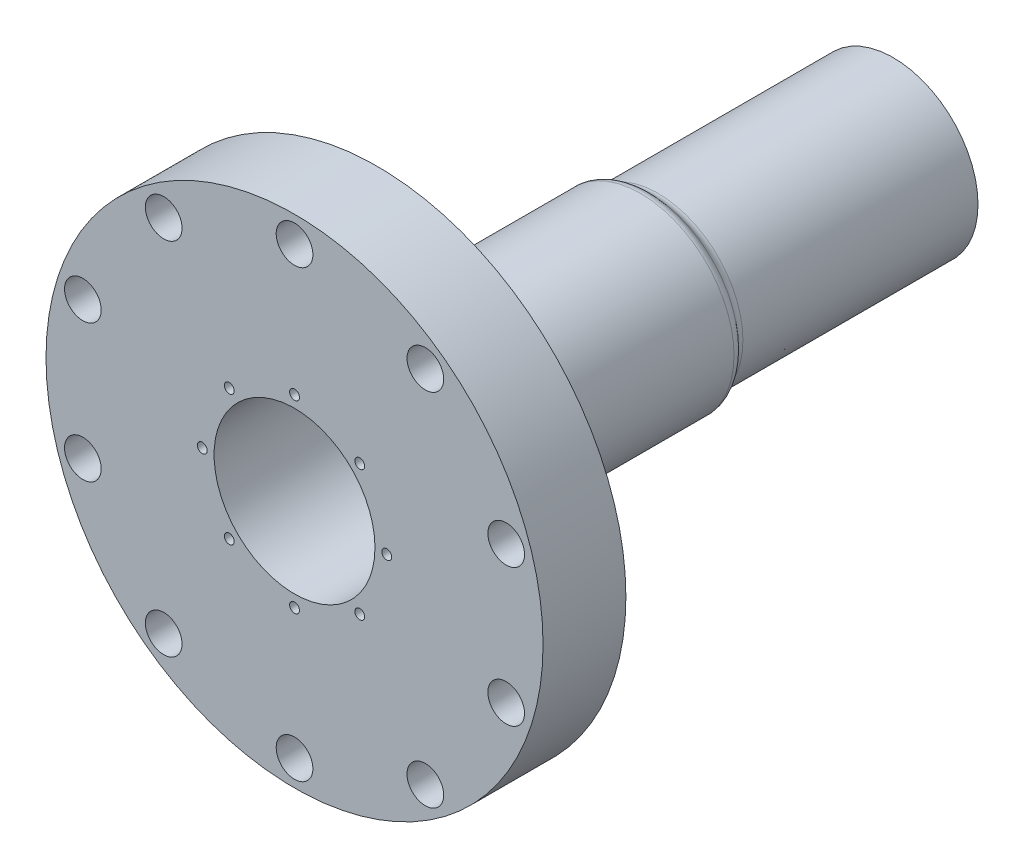
ISO-10303-21;
HEADER;
FILE_DESCRIPTION(('STEP AP214'),'2;1');
FILE_NAME('part.step','',(''),(''),'','','');
FILE_SCHEMA(('AUTOMOTIVE_DESIGN { 1 0 10303 214 1 1 1 1 }'));
ENDSEC;
DATA;
#1=APPLICATION_CONTEXT('core data for automotive mechanical design processes');
#2=APPLICATION_PROTOCOL_DEFINITION('international standard','automotive_design',2000,#1);
#3=PRODUCT_CONTEXT('',#1,'mechanical');
#4=PRODUCT('Part','Part','',(#3));
#5=PRODUCT_RELATED_PRODUCT_CATEGORY('part','',(#4));
#6=PRODUCT_DEFINITION_FORMATION('','',#4);
#7=PRODUCT_DEFINITION_CONTEXT('part definition',#1,'design');
#8=PRODUCT_DEFINITION('design','',#6,#7);
#9=PRODUCT_DEFINITION_SHAPE('','',#8);
#10=(LENGTH_UNIT() NAMED_UNIT(*) SI_UNIT(.MILLI.,.METRE.));
#11=(NAMED_UNIT(*) PLANE_ANGLE_UNIT() SI_UNIT($,.RADIAN.));
#12=(NAMED_UNIT(*) SI_UNIT($,.STERADIAN.) SOLID_ANGLE_UNIT());
#13=UNCERTAINTY_MEASURE_WITH_UNIT(LENGTH_MEASURE(1.E-05),#10,'distance_accuracy_value','');
#14=(GEOMETRIC_REPRESENTATION_CONTEXT(3) GLOBAL_UNCERTAINTY_ASSIGNED_CONTEXT((#13)) GLOBAL_UNIT_ASSIGNED_CONTEXT((#10,
#11,#12)) REPRESENTATION_CONTEXT('',''));
#15=CARTESIAN_POINT('',(0.,0.,0.));
#16=DIRECTION('',(0.,0.,1.));
#17=DIRECTION('',(1.,0.,0.));
#18=AXIS2_PLACEMENT_3D('',#15,#16,#17);
#19=CARTESIAN_POINT('',(0.,0.,-19.05));
#20=DIRECTION('',(0.,0.,1.));
#21=DIRECTION('',(1.,0.,0.));
#22=AXIS2_PLACEMENT_3D('',#19,#20,#21);
#23=PLANE('',#22);
#24=CARTESIAN_POINT('',(0.,0.,-19.05));
#25=DIRECTION('',(0.,0.,1.));
#26=DIRECTION('',(1.,0.,0.));
#27=AXIS2_PLACEMENT_3D('',#24,#25,#26);
#28=CIRCLE('',#27,57.15);
#29=CARTESIAN_POINT('',(57.15,0.,-19.05));
#30=VERTEX_POINT('',#29);
#31=EDGE_CURVE('E189',#30,#30,#28,.T.);
#32=ORIENTED_EDGE('',*,*,#31,.F.);
#33=EDGE_LOOP('',(#32));
#34=FACE_BOUND('',#33,.T.);
#35=CARTESIAN_POINT('',(0.,51.181,-19.05));
#36=DIRECTION('',(0.,0.,1.));
#37=DIRECTION('',(1.,0.,0.));
#38=AXIS2_PLACEMENT_3D('',#35,#36,#37);
#39=CIRCLE('',#38,4.2164);
#40=CARTESIAN_POINT('',(4.2164,51.181,-19.05));
#41=VERTEX_POINT('',#40);
#42=EDGE_CURVE('E185',#41,#41,#39,.F.);
#43=ORIENTED_EDGE('',*,*,#42,.F.);
#44=EDGE_LOOP('',(#43));
#45=FACE_BOUND('',#44,.T.);
#46=CARTESIAN_POINT('',(-30.0834369975811,41.4062987891042,-19.05));
#47=DIRECTION('',(0.,0.,1.));
#48=DIRECTION('',(1.,0.,0.));
#49=AXIS2_PLACEMENT_3D('',#46,#47,#48);
#50=CIRCLE('',#49,4.2164);
#51=CARTESIAN_POINT('',(-25.8670369975811,41.4062987891042,-19.05));
#52=VERTEX_POINT('',#51);
#53=EDGE_CURVE('E179',#52,#52,#50,.F.);
#54=ORIENTED_EDGE('',*,*,#53,.F.);
#55=EDGE_LOOP('',(#54));
#56=FACE_BOUND('',#55,.T.);
#57=CARTESIAN_POINT('',(-48.6760235605023,15.8157987891041,-19.05));
#58=DIRECTION('',(0.,0.,1.));
#59=DIRECTION('',(1.,0.,0.));
#60=AXIS2_PLACEMENT_3D('',#57,#58,#59);
#61=CIRCLE('',#60,4.2164);
#62=CARTESIAN_POINT('',(-44.4596235605023,15.8157987891041,-19.05));
#63=VERTEX_POINT('',#62);
#64=EDGE_CURVE('E173',#63,#63,#61,.F.);
#65=ORIENTED_EDGE('',*,*,#64,.F.);
#66=EDGE_LOOP('',(#65));
#67=FACE_BOUND('',#66,.T.);
#68=CARTESIAN_POINT('',(-48.6760235605022,-15.8157987891044,-19.05));
#69=DIRECTION('',(0.,0.,1.));
#70=DIRECTION('',(1.,0.,0.));
#71=AXIS2_PLACEMENT_3D('',#68,#69,#70);
#72=CIRCLE('',#71,4.2164);
#73=CARTESIAN_POINT('',(-44.4596235605022,-15.8157987891044,-19.05));
#74=VERTEX_POINT('',#73);
#75=EDGE_CURVE('E167',#74,#74,#72,.F.);
#76=ORIENTED_EDGE('',*,*,#75,.F.);
#77=EDGE_LOOP('',(#76));
#78=FACE_BOUND('',#77,.T.);
#79=CARTESIAN_POINT('',(-30.0834369975808,-41.4062987891044,-19.05));
#80=DIRECTION('',(0.,0.,1.));
#81=DIRECTION('',(1.,0.,0.));
#82=AXIS2_PLACEMENT_3D('',#79,#80,#81);
#83=CIRCLE('',#82,4.2164);
#84=CARTESIAN_POINT('',(-25.8670369975808,-41.4062987891044,-19.05));
#85=VERTEX_POINT('',#84);
#86=EDGE_CURVE('E161',#85,#85,#83,.F.);
#87=ORIENTED_EDGE('',*,*,#86,.F.);
#88=EDGE_LOOP('',(#87));
#89=FACE_BOUND('',#88,.T.);
#90=CARTESIAN_POINT('',(3.57395219809879E-13,-51.181,-19.05));
#91=DIRECTION('',(0.,0.,1.));
#92=DIRECTION('',(1.,0.,0.));
#93=AXIS2_PLACEMENT_3D('',#90,#91,#92);
#94=CIRCLE('',#93,4.2164);
#95=CARTESIAN_POINT('',(4.21640000000036,-51.181,-19.05));
#96=VERTEX_POINT('',#95);
#97=EDGE_CURVE('E155',#96,#96,#94,.F.);
#98=ORIENTED_EDGE('',*,*,#97,.F.);
#99=EDGE_LOOP('',(#98));
#100=FACE_BOUND('',#99,.T.);
#101=CARTESIAN_POINT('',(30.0834369975814,-41.4062987891039,-19.05));
#102=DIRECTION('',(0.,0.,1.));
#103=DIRECTION('',(1.,0.,0.));
#104=AXIS2_PLACEMENT_3D('',#101,#102,#103);
#105=CIRCLE('',#104,4.2164);
#106=CARTESIAN_POINT('',(34.2998369975814,-41.4062987891039,-19.05));
#107=VERTEX_POINT('',#106);
#108=EDGE_CURVE('E149',#107,#107,#105,.F.);
#109=ORIENTED_EDGE('',*,*,#108,.F.);
#110=EDGE_LOOP('',(#109));
#111=FACE_BOUND('',#110,.T.);
#112=CARTESIAN_POINT('',(48.6760235605024,-15.8157987891037,-19.05));
#113=DIRECTION('',(0.,0.,1.));
#114=DIRECTION('',(1.,0.,0.));
#115=AXIS2_PLACEMENT_3D('',#112,#113,#114);
#116=CIRCLE('',#115,4.2164);
#117=CARTESIAN_POINT('',(52.8924235605024,-15.8157987891037,-19.05));
#118=VERTEX_POINT('',#117);
#119=EDGE_CURVE('E143',#118,#118,#116,.F.);
#120=ORIENTED_EDGE('',*,*,#119,.F.);
#121=EDGE_LOOP('',(#120));
#122=FACE_BOUND('',#121,.T.);
#123=CARTESIAN_POINT('',(48.6760235605021,15.8157987891047,-19.05));
#124=DIRECTION('',(0.,0.,1.));
#125=DIRECTION('',(1.,0.,0.));
#126=AXIS2_PLACEMENT_3D('',#123,#124,#125);
#127=CIRCLE('',#126,4.2164);
#128=CARTESIAN_POINT('',(52.8924235605021,15.8157987891047,-19.05));
#129=VERTEX_POINT('',#128);
#130=EDGE_CURVE('E137',#129,#129,#127,.F.);
#131=ORIENTED_EDGE('',*,*,#130,.F.);
#132=EDGE_LOOP('',(#131));
#133=FACE_BOUND('',#132,.T.);
#134=CARTESIAN_POINT('',(30.0834369975805,41.4062987891046,-19.05));
#135=DIRECTION('',(0.,0.,1.));
#136=DIRECTION('',(1.,0.,0.));
#137=AXIS2_PLACEMENT_3D('',#134,#135,#136);
#138=CIRCLE('',#137,4.2164);
#139=CARTESIAN_POINT('',(34.2998369975805,41.4062987891046,-19.05));
#140=VERTEX_POINT('',#139);
#141=EDGE_CURVE('E131',#140,#140,#138,.F.);
#142=ORIENTED_EDGE('',*,*,#141,.F.);
#143=EDGE_LOOP('',(#142));
#144=FACE_BOUND('',#143,.T.);
#145=CARTESIAN_POINT('',(0.,0.,-19.05));
#146=DIRECTION('',(0.,0.,1.));
#147=DIRECTION('',(1.,0.,0.));
#148=AXIS2_PLACEMENT_3D('',#145,#146,#147);
#149=CIRCLE('',#148,21.5);
#150=CARTESIAN_POINT('',(21.5,0.,-19.05));
#151=VERTEX_POINT('',#150);
#152=EDGE_CURVE('E200',#151,#151,#149,.F.);
#153=ORIENTED_EDGE('',*,*,#152,.F.);
#154=EDGE_LOOP('',(#153));
#155=FACE_BOUND('',#154,.T.);
#156=ADVANCED_FACE('F36',(#34,#45,#56,#67,#78,#89,#100,#111,#122,#133,#144,#155),#23,.F.);
#157=CARTESIAN_POINT('',(0.,0.,-137.668));
#158=DIRECTION('',(0.,0.,1.));
#159=DIRECTION('',(1.,0.,0.));
#160=AXIS2_PLACEMENT_3D('',#157,#158,#159);
#161=CYLINDRICAL_SURFACE('',#160,18.5);
#162=CARTESIAN_POINT('',(0.,0.,0.));
#163=DIRECTION('',(0.,0.,1.));
#164=DIRECTION('',(1.,0.,0.));
#165=AXIS2_PLACEMENT_3D('',#162,#163,#164);
#166=CIRCLE('',#165,18.5);
#167=CARTESIAN_POINT('',(18.5,0.,0.));
#168=VERTEX_POINT('',#167);
#169=EDGE_CURVE('E192',#168,#168,#166,.T.);
#170=ORIENTED_EDGE('',*,*,#169,.T.);
#171=EDGE_LOOP('',(#170));
#172=FACE_BOUND('',#171,.T.);
#173=CARTESIAN_POINT('',(0.,0.,-112.268));
#174=DIRECTION('',(0.,0.,-1.));
#175=DIRECTION('',(-1.,0.,0.));
#176=AXIS2_PLACEMENT_3D('',#173,#174,#175);
#177=CIRCLE('',#176,18.5);
#178=CARTESIAN_POINT('',(-18.5,0.,-112.268));
#179=VERTEX_POINT('',#178);
#180=EDGE_CURVE('E86',#179,#179,#177,.F.);
#181=ORIENTED_EDGE('',*,*,#180,.F.);
#182=EDGE_LOOP('',(#181));
#183=FACE_BOUND('',#182,.T.);
#184=ADVANCED_FACE('F222',(#172,#183),#161,.F.);
#185=CARTESIAN_POINT('',(0.,0.,-137.668));
#186=DIRECTION('',(0.,0.,1.));
#187=DIRECTION('',(1.,0.,0.));
#188=AXIS2_PLACEMENT_3D('',#185,#186,#187);
#189=CYLINDRICAL_SURFACE('',#188,19.5);
#190=CARTESIAN_POINT('',(0.,0.,-83.6078672461467));
#191=DIRECTION('',(0.,0.,1.));
#192=DIRECTION('',(1.,0.,0.));
#193=AXIS2_PLACEMENT_3D('',#190,#191,#192);
#194=CIRCLE('',#193,19.5);
#195=CARTESIAN_POINT('',(19.5,0.,-83.6078672461467));
#196=VERTEX_POINT('',#195);
#197=EDGE_CURVE('E11',#196,#196,#194,.F.);
#198=ORIENTED_EDGE('',*,*,#197,.T.);
#199=EDGE_LOOP('',(#198));
#200=FACE_BOUND('',#199,.T.);
#201=CARTESIAN_POINT('',(0.,0.,-137.668));
#202=DIRECTION('',(0.,0.,1.));
#203=DIRECTION('',(1.,0.,0.));
#204=AXIS2_PLACEMENT_3D('',#201,#202,#203);
#205=CIRCLE('',#204,19.5);
#206=CARTESIAN_POINT('',(19.5,0.,-137.668));
#207=VERTEX_POINT('',#206);
#208=EDGE_CURVE('E197',#207,#207,#205,.T.);
#209=ORIENTED_EDGE('',*,*,#208,.T.);
#210=EDGE_LOOP('',(#209));
#211=FACE_BOUND('',#210,.T.);
#212=ADVANCED_FACE('F228',(#200,#211),#189,.T.);
#213=CARTESIAN_POINT('',(0.,0.,-137.668));
#214=DIRECTION('',(0.,0.,1.));
#215=DIRECTION('',(1.,0.,0.));
#216=AXIS2_PLACEMENT_3D('',#213,#214,#215);
#217=PLANE('',#216);
#218=CARTESIAN_POINT('',(0.,0.,-137.668));
#219=DIRECTION('',(0.,0.,-1.));
#220=DIRECTION('',(-1.,0.,0.));
#221=AXIS2_PLACEMENT_3D('',#218,#219,#220);
#222=CIRCLE('',#221,19.);
#223=CARTESIAN_POINT('',(-19.,0.,-137.668));
#224=VERTEX_POINT('',#223);
#225=EDGE_CURVE('E619',#224,#224,#222,.T.);
#226=ORIENTED_EDGE('',*,*,#225,.F.);
#227=EDGE_LOOP('',(#226));
#228=FACE_BOUND('',#227,.T.);
#229=ORIENTED_EDGE('',*,*,#208,.F.);
#230=EDGE_LOOP('',(#229));
#231=FACE_BOUND('',#230,.T.);
#232=ADVANCED_FACE('F242',(#228,#231),#217,.F.);
#233=CARTESIAN_POINT('',(0.,0.,0.));
#234=DIRECTION('',(0.,0.,1.));
#235=DIRECTION('',(1.,0.,0.));
#236=AXIS2_PLACEMENT_3D('',#233,#234,#235);
#237=PLANE('',#236);
#238=CARTESIAN_POINT('',(15.,-15.,0.));
#239=DIRECTION('',(0.,0.,1.));
#240=DIRECTION('',(1.,0.,0.));
#241=AXIS2_PLACEMENT_3D('',#238,#239,#240);
#242=CIRCLE('',#241,1.13029999999999);
#243=CARTESIAN_POINT('',(16.1303,-15.,0.));
#244=VERTEX_POINT('',#243);
#245=EDGE_CURVE('E80',#244,#244,#242,.T.);
#246=ORIENTED_EDGE('',*,*,#245,.F.);
#247=EDGE_LOOP('',(#246));
#248=FACE_BOUND('',#247,.T.);
#249=CARTESIAN_POINT('',(-15.,-15.,0.));
#250=DIRECTION('',(0.,0.,1.));
#251=DIRECTION('',(1.,0.,0.));
#252=AXIS2_PLACEMENT_3D('',#249,#250,#251);
#253=CIRCLE('',#252,1.13029999999999);
#254=CARTESIAN_POINT('',(-13.8697,-15.,0.));
#255=VERTEX_POINT('',#254);
#256=EDGE_CURVE('E79',#255,#255,#253,.T.);
#257=ORIENTED_EDGE('',*,*,#256,.F.);
#258=EDGE_LOOP('',(#257));
#259=FACE_BOUND('',#258,.T.);
#260=CARTESIAN_POINT('',(-15.,15.,0.));
#261=DIRECTION('',(0.,0.,1.));
#262=DIRECTION('',(1.,0.,0.));
#263=AXIS2_PLACEMENT_3D('',#260,#261,#262);
#264=CIRCLE('',#263,1.13029999999999);
#265=CARTESIAN_POINT('',(-13.8697,15.,0.));
#266=VERTEX_POINT('',#265);
#267=EDGE_CURVE('E92',#266,#266,#264,.T.);
#268=ORIENTED_EDGE('',*,*,#267,.F.);
#269=EDGE_LOOP('',(#268));
#270=FACE_BOUND('',#269,.T.);
#271=CARTESIAN_POINT('',(15.,15.,0.));
#272=DIRECTION('',(0.,0.,1.));
#273=DIRECTION('',(1.,0.,0.));
#274=AXIS2_PLACEMENT_3D('',#271,#272,#273);
#275=CIRCLE('',#274,1.13029999999999);
#276=CARTESIAN_POINT('',(16.1303,15.,0.));
#277=VERTEX_POINT('',#276);
#278=EDGE_CURVE('E98',#277,#277,#275,.T.);
#279=ORIENTED_EDGE('',*,*,#278,.F.);
#280=EDGE_LOOP('',(#279));
#281=FACE_BOUND('',#280,.T.);
#282=CARTESIAN_POINT('',(0.,21.2132034355964,0.));
#283=DIRECTION('',(0.,0.,1.));
#284=DIRECTION('',(1.,0.,0.));
#285=AXIS2_PLACEMENT_3D('',#282,#283,#284);
#286=CIRCLE('',#285,1.13029999999999);
#287=CARTESIAN_POINT('',(1.13030000000002,21.2132034355964,0.));
#288=VERTEX_POINT('',#287);
#289=EDGE_CURVE('E104',#288,#288,#286,.T.);
#290=ORIENTED_EDGE('',*,*,#289,.F.);
#291=EDGE_LOOP('',(#290));
#292=FACE_BOUND('',#291,.T.);
#293=CARTESIAN_POINT('',(-21.2132034355965,0.,0.));
#294=DIRECTION('',(0.,0.,1.));
#295=DIRECTION('',(1.,0.,0.));
#296=AXIS2_PLACEMENT_3D('',#293,#294,#295);
#297=CIRCLE('',#296,1.13029999999999);
#298=CARTESIAN_POINT('',(-20.0829034355965,0.,0.));
#299=VERTEX_POINT('',#298);
#300=EDGE_CURVE('E110',#299,#299,#297,.T.);
#301=ORIENTED_EDGE('',*,*,#300,.F.);
#302=EDGE_LOOP('',(#301));
#303=FACE_BOUND('',#302,.T.);
#304=CARTESIAN_POINT('',(21.2132034355965,0.,0.));
#305=DIRECTION('',(0.,0.,1.));
#306=DIRECTION('',(1.,0.,0.));
#307=AXIS2_PLACEMENT_3D('',#304,#305,#306);
#308=CIRCLE('',#307,1.13029999999999);
#309=CARTESIAN_POINT('',(22.3435034355964,0.,0.));
#310=VERTEX_POINT('',#309);
#311=EDGE_CURVE('E116',#310,#310,#308,.T.);
#312=ORIENTED_EDGE('',*,*,#311,.F.);
#313=EDGE_LOOP('',(#312));
#314=FACE_BOUND('',#313,.T.);
#315=CARTESIAN_POINT('',(0.,-21.2132034355964,0.));
#316=DIRECTION('',(0.,0.,1.));
#317=DIRECTION('',(1.,0.,0.));
#318=AXIS2_PLACEMENT_3D('',#315,#316,#317);
#319=CIRCLE('',#318,1.13029999999999);
#320=CARTESIAN_POINT('',(1.13029999999999,-21.2132034355964,0.));
#321=VERTEX_POINT('',#320);
#322=EDGE_CURVE('E122',#321,#321,#319,.T.);
#323=ORIENTED_EDGE('',*,*,#322,.F.);
#324=EDGE_LOOP('',(#323));
#325=FACE_BOUND('',#324,.T.);
#326=CARTESIAN_POINT('',(30.0834369975805,41.4062987891046,0.));
#327=DIRECTION('',(0.,0.,1.));
#328=DIRECTION('',(0.809016994374955,-0.587785252292462,0.));
#329=AXIS2_PLACEMENT_3D('',#326,#327,#328);
#330=CIRCLE('',#329,4.2164);
#331=CARTESIAN_POINT('',(33.4945762526631,38.9279610513386,0.));
#332=VERTEX_POINT('',#331);
#333=EDGE_CURVE('E128',#332,#332,#330,.T.);
#334=ORIENTED_EDGE('',*,*,#333,.F.);
#335=EDGE_LOOP('',(#334));
#336=FACE_BOUND('',#335,.T.);
#337=CARTESIAN_POINT('',(48.6760235605021,15.8157987891047,0.));
#338=DIRECTION('',(0.,0.,1.));
#339=DIRECTION('',(0.309016994374958,-0.95105651629515,0.));
#340=AXIS2_PLACEMENT_3D('',#337,#338,#339);
#341=CIRCLE('',#340,4.2164);
#342=CARTESIAN_POINT('',(49.9789628155847,11.8057640937979,0.));
#343=VERTEX_POINT('',#342);
#344=EDGE_CURVE('E134',#343,#343,#341,.T.);
#345=ORIENTED_EDGE('',*,*,#344,.F.);
#346=EDGE_LOOP('',(#345));
#347=FACE_BOUND('',#346,.T.);
#348=CARTESIAN_POINT('',(48.6760235605024,-15.8157987891037,0.));
#349=DIRECTION('',(0.,0.,1.));
#350=DIRECTION('',(-0.309016994374938,-0.951056516295157,0.));
#351=AXIS2_PLACEMENT_3D('',#348,#349,#350);
#352=CIRCLE('',#351,4.2164);
#353=CARTESIAN_POINT('',(47.3730843054199,-19.8258334844106,0.));
#354=VERTEX_POINT('',#353);
#355=EDGE_CURVE('E140',#354,#354,#352,.T.);
#356=ORIENTED_EDGE('',*,*,#355,.F.);
#357=EDGE_LOOP('',(#356));
#358=FACE_BOUND('',#357,.T.);
#359=CARTESIAN_POINT('',(30.0834369975814,-41.4062987891039,0.));
#360=DIRECTION('',(0.,0.,1.));
#361=DIRECTION('',(-0.809016994374942,-0.58778525229248,0.));
#362=AXIS2_PLACEMENT_3D('',#359,#360,#361);
#363=CIRCLE('',#362,4.2164);
#364=CARTESIAN_POINT('',(26.6722977424989,-43.8846365268699,0.));
#365=VERTEX_POINT('',#364);
#366=EDGE_CURVE('E146',#365,#365,#363,.T.);
#367=ORIENTED_EDGE('',*,*,#366,.F.);
#368=EDGE_LOOP('',(#367));
#369=FACE_BOUND('',#368,.T.);
#370=CARTESIAN_POINT('',(3.57395219809879E-13,-51.181,0.));
#371=DIRECTION('',(0.,0.,1.));
#372=DIRECTION('',(-1.,0.,0.));
#373=AXIS2_PLACEMENT_3D('',#370,#371,#372);
#374=CIRCLE('',#373,4.2164);
#375=CARTESIAN_POINT('',(-4.21639999999964,-51.181,0.));
#376=VERTEX_POINT('',#375);
#377=EDGE_CURVE('E152',#376,#376,#374,.T.);
#378=ORIENTED_EDGE('',*,*,#377,.F.);
#379=EDGE_LOOP('',(#378));
#380=FACE_BOUND('',#379,.T.);
#381=CARTESIAN_POINT('',(-30.0834369975808,-41.4062987891044,0.));
#382=DIRECTION('',(0.,0.,1.));
#383=DIRECTION('',(-0.809016994374951,0.587785252292469,0.));
#384=AXIS2_PLACEMENT_3D('',#381,#382,#383);
#385=CIRCLE('',#384,4.2164);
#386=CARTESIAN_POINT('',(-33.4945762526634,-38.9279610513384,0.));
#387=VERTEX_POINT('',#386);
#388=EDGE_CURVE('E158',#387,#387,#385,.T.);
#389=ORIENTED_EDGE('',*,*,#388,.F.);
#390=EDGE_LOOP('',(#389));
#391=FACE_BOUND('',#390,.T.);
#392=CARTESIAN_POINT('',(-48.6760235605022,-15.8157987891044,0.));
#393=DIRECTION('',(0.,0.,1.));
#394=DIRECTION('',(-0.309016994374952,0.951056516295152,0.));
#395=AXIS2_PLACEMENT_3D('',#392,#393,#394);
#396=CIRCLE('',#395,4.2164);
#397=CARTESIAN_POINT('',(-49.9789628155847,-11.8057640937975,0.));
#398=VERTEX_POINT('',#397);
#399=EDGE_CURVE('E164',#398,#398,#396,.T.);
#400=ORIENTED_EDGE('',*,*,#399,.F.);
#401=EDGE_LOOP('',(#400));
#402=FACE_BOUND('',#401,.T.);
#403=CARTESIAN_POINT('',(-48.6760235605023,15.8157987891041,0.));
#404=DIRECTION('',(0.,0.,1.));
#405=DIRECTION('',(0.309016994374945,0.951056516295155,0.));
#406=AXIS2_PLACEMENT_3D('',#403,#404,#405);
#407=CIRCLE('',#406,4.2164);
#408=CARTESIAN_POINT('',(-47.3730843054198,19.8258334844109,0.));
#409=VERTEX_POINT('',#408);
#410=EDGE_CURVE('E170',#409,#409,#407,.T.);
#411=ORIENTED_EDGE('',*,*,#410,.F.);
#412=EDGE_LOOP('',(#411));
#413=FACE_BOUND('',#412,.T.);
#414=CARTESIAN_POINT('',(-30.0834369975811,41.4062987891042,0.));
#415=DIRECTION('',(0.,0.,1.));
#416=DIRECTION('',(0.809016994374947,0.587785252292474,0.));
#417=AXIS2_PLACEMENT_3D('',#414,#415,#416);
#418=CIRCLE('',#417,4.2164);
#419=CARTESIAN_POINT('',(-26.6722977424986,43.8846365268701,0.));
#420=VERTEX_POINT('',#419);
#421=EDGE_CURVE('E176',#420,#420,#418,.T.);
#422=ORIENTED_EDGE('',*,*,#421,.F.);
#423=EDGE_LOOP('',(#422));
#424=FACE_BOUND('',#423,.T.);
#425=CARTESIAN_POINT('',(0.,51.181,0.));
#426=DIRECTION('',(0.,0.,1.));
#427=DIRECTION('',(1.,0.,0.));
#428=AXIS2_PLACEMENT_3D('',#425,#426,#427);
#429=CIRCLE('',#428,4.2164);
#430=CARTESIAN_POINT('',(4.2164,51.181,0.));
#431=VERTEX_POINT('',#430);
#432=EDGE_CURVE('E182',#431,#431,#429,.T.);
#433=ORIENTED_EDGE('',*,*,#432,.F.);
#434=EDGE_LOOP('',(#433));
#435=FACE_BOUND('',#434,.T.);
#436=ORIENTED_EDGE('',*,*,#169,.F.);
#437=EDGE_LOOP('',(#436));
#438=FACE_BOUND('',#437,.T.);
#439=CARTESIAN_POINT('',(0.,0.,0.));
#440=DIRECTION('',(0.,0.,1.));
#441=DIRECTION('',(1.,0.,0.));
#442=AXIS2_PLACEMENT_3D('',#439,#440,#441);
#443=CIRCLE('',#442,57.15);
#444=CARTESIAN_POINT('',(57.15,0.,0.));
#445=VERTEX_POINT('',#444);
#446=EDGE_CURVE('E188',#445,#445,#443,.T.);
#447=ORIENTED_EDGE('',*,*,#446,.T.);
#448=EDGE_LOOP('',(#447));
#449=FACE_BOUND('',#448,.T.);
#450=ADVANCED_FACE('F239',(#248,#259,#270,#281,#292,#303,#314,#325,#336,#347,#358,#369,#380,
#391,#402,#413,#424,#435,#438,#449),#237,.T.);
#451=CARTESIAN_POINT('',(0.,0.,-19.05));
#452=DIRECTION('',(0.,0.,1.));
#453=DIRECTION('',(1.,0.,0.));
#454=AXIS2_PLACEMENT_3D('',#451,#452,#453);
#455=CYLINDRICAL_SURFACE('',#454,57.15);
#456=CARTESIAN_POINT('',(57.15,0.,-19.05));
#457=CARTESIAN_POINT('',(57.15,0.,-18.8515625));
#458=CARTESIAN_POINT('',(57.15,0.,-18.653125));
#459=CARTESIAN_POINT('',(57.15,0.,-18.25625));
#460=CARTESIAN_POINT('',(57.15,0.,-18.0578125));
#461=CARTESIAN_POINT('',(57.15,0.,-17.6609375));
#462=CARTESIAN_POINT('',(57.15,0.,-17.4625));
#463=CARTESIAN_POINT('',(57.15,0.,-17.065625));
#464=CARTESIAN_POINT('',(57.15,0.,-16.8671875));
#465=CARTESIAN_POINT('',(57.15,0.,-16.4703125));
#466=CARTESIAN_POINT('',(57.15,0.,-16.271875));
#467=CARTESIAN_POINT('',(57.15,0.,-15.875));
#468=CARTESIAN_POINT('',(57.15,0.,-15.6765625));
#469=CARTESIAN_POINT('',(57.15,0.,-15.2796875));
#470=CARTESIAN_POINT('',(57.15,0.,-15.08125));
#471=CARTESIAN_POINT('',(57.15,0.,-14.684375));
#472=CARTESIAN_POINT('',(57.15,0.,-14.4859375));
#473=CARTESIAN_POINT('',(57.15,0.,-14.0890625));
#474=CARTESIAN_POINT('',(57.15,0.,-13.890625));
#475=CARTESIAN_POINT('',(57.15,0.,-13.49375));
#476=CARTESIAN_POINT('',(57.15,0.,-13.2953125));
#477=CARTESIAN_POINT('',(57.15,0.,-12.8984375));
#478=CARTESIAN_POINT('',(57.15,0.,-12.7));
#479=CARTESIAN_POINT('',(57.15,0.,-12.303125));
#480=CARTESIAN_POINT('',(57.15,0.,-12.1046875));
#481=CARTESIAN_POINT('',(57.15,0.,-11.7078125));
#482=CARTESIAN_POINT('',(57.15,0.,-11.509375));
#483=CARTESIAN_POINT('',(57.15,0.,-11.1125));
#484=CARTESIAN_POINT('',(57.15,0.,-10.9140625));
#485=CARTESIAN_POINT('',(57.15,0.,-10.5171875));
#486=CARTESIAN_POINT('',(57.15,0.,-10.31875));
#487=CARTESIAN_POINT('',(57.15,0.,-9.921875));
#488=CARTESIAN_POINT('',(57.15,0.,-9.7234375));
#489=CARTESIAN_POINT('',(57.15,0.,-9.3265625));
#490=CARTESIAN_POINT('',(57.15,0.,-9.128125));
#491=CARTESIAN_POINT('',(57.15,0.,-8.73125));
#492=CARTESIAN_POINT('',(57.15,0.,-8.5328125));
#493=CARTESIAN_POINT('',(57.15,0.,-8.1359375));
#494=CARTESIAN_POINT('',(57.15,0.,-7.9375));
#495=CARTESIAN_POINT('',(57.15,0.,-7.540625));
#496=CARTESIAN_POINT('',(57.15,0.,-7.3421875));
#497=CARTESIAN_POINT('',(57.15,0.,-6.9453125));
#498=CARTESIAN_POINT('',(57.15,0.,-6.746875));
#499=CARTESIAN_POINT('',(57.15,0.,-6.35));
#500=CARTESIAN_POINT('',(57.15,0.,-6.1515625));
#501=CARTESIAN_POINT('',(57.15,0.,-5.7546875));
#502=CARTESIAN_POINT('',(57.15,0.,-5.55625));
#503=CARTESIAN_POINT('',(57.15,0.,-5.159375));
#504=CARTESIAN_POINT('',(57.15,0.,-4.9609375));
#505=CARTESIAN_POINT('',(57.15,0.,-4.5640625));
#506=CARTESIAN_POINT('',(57.15,0.,-4.365625));
#507=CARTESIAN_POINT('',(57.15,0.,-3.96875));
#508=CARTESIAN_POINT('',(57.15,0.,-3.7703125));
#509=CARTESIAN_POINT('',(57.15,0.,-3.3734375));
#510=CARTESIAN_POINT('',(57.15,0.,-3.175));
#511=CARTESIAN_POINT('',(57.15,0.,-2.778125));
#512=CARTESIAN_POINT('',(57.15,0.,-2.5796875));
#513=CARTESIAN_POINT('',(57.15,0.,-2.1828125));
#514=CARTESIAN_POINT('',(57.15,0.,-1.984375));
#515=CARTESIAN_POINT('',(57.15,0.,-1.5875));
#516=CARTESIAN_POINT('',(57.15,0.,-1.3890625));
#517=CARTESIAN_POINT('',(57.15,0.,-0.992187500000001));
#518=CARTESIAN_POINT('',(57.15,0.,-0.793750000000001));
#519=CARTESIAN_POINT('',(57.15,0.,-0.396875));
#520=CARTESIAN_POINT('',(57.15,0.,-0.1984375));
#521=CARTESIAN_POINT('',(57.15,0.,0.));
#522=B_SPLINE_CURVE_WITH_KNOTS('',3,(#456,#457,#458,#459,#460,#461,#462,#463,#464,#465,#466,
#467,#468,#469,#470,#471,#472,#473,#474,#475,#476,#477,#478,#479,#480,#481,#482,#483,#484,#485,
#486,#487,#488,#489,#490,#491,#492,#493,#494,#495,#496,#497,#498,#499,#500,#501,#502,#503,#504,
#505,#506,#507,#508,#509,#510,#511,#512,#513,#514,#515,#516,#517,#518,#519,#520,#521),
.UNSPECIFIED.,.F.,.F.,(4,2,2,2,2,2,2,2,2,2,2,2,2,2,2,2,2,2,2,2,2,2,2,2,2,2,2,2,2,2,2,2,4),(0.,
0.5953125,1.190625,1.7859375,2.38125,2.9765625,3.571875,4.1671875,4.7625,5.3578125,5.953125,
6.5484375,7.14375,7.7390625,8.334375,8.9296875,9.525,10.1203125,10.715625,11.3109375,11.90625,
12.5015625,13.096875,13.6921875,14.2875,14.8828125,15.478125,16.0734375,16.66875,17.2640625,
17.859375,18.4546875,19.05),.UNSPECIFIED.);
#523=EDGE_CURVE('BSEAM237',#30,#445,#522,.T.);
#524=ORIENTED_EDGE('',*,*,#31,.T.);
#525=ORIENTED_EDGE('',*,*,#446,.F.);
#526=ORIENTED_EDGE('',*,*,#523,.T.);
#527=ORIENTED_EDGE('',*,*,#523,.F.);
#528=EDGE_LOOP('',(#524,#526,#525,#527));
#529=FACE_BOUND('',#528,.T.);
#530=ADVANCED_FACE('F237',(#529),#455,.T.);
#531=CARTESIAN_POINT('',(0.,51.181,-137.669));
#532=DIRECTION('',(0.,0.,1.));
#533=DIRECTION('',(1.,0.,0.));
#534=AXIS2_PLACEMENT_3D('',#531,#532,#533);
#535=CYLINDRICAL_SURFACE('',#534,4.2164);
#536=ORIENTED_EDGE('',*,*,#432,.T.);
#537=EDGE_LOOP('',(#536));
#538=FACE_BOUND('',#537,.T.);
#539=ORIENTED_EDGE('',*,*,#42,.T.);
#540=EDGE_LOOP('',(#539));
#541=FACE_BOUND('',#540,.T.);
#542=ADVANCED_FACE('F235',(#538,#541),#535,.F.);
#543=CARTESIAN_POINT('',(-30.0834369975811,41.4062987891042,-137.669));
#544=DIRECTION('',(0.,0.,1.));
#545=DIRECTION('',(1.,0.,0.));
#546=AXIS2_PLACEMENT_3D('',#543,#544,#545);
#547=CYLINDRICAL_SURFACE('',#546,4.2164);
#548=ORIENTED_EDGE('',*,*,#421,.T.);
#549=EDGE_LOOP('',(#548));
#550=FACE_BOUND('',#549,.T.);
#551=ORIENTED_EDGE('',*,*,#53,.T.);
#552=EDGE_LOOP('',(#551));
#553=FACE_BOUND('',#552,.T.);
#554=ADVANCED_FACE('F281',(#550,#553),#547,.F.);
#555=CARTESIAN_POINT('',(-48.6760235605023,15.8157987891041,-137.669));
#556=DIRECTION('',(0.,0.,1.));
#557=DIRECTION('',(1.,0.,0.));
#558=AXIS2_PLACEMENT_3D('',#555,#556,#557);
#559=CYLINDRICAL_SURFACE('',#558,4.2164);
#560=ORIENTED_EDGE('',*,*,#410,.T.);
#561=EDGE_LOOP('',(#560));
#562=FACE_BOUND('',#561,.T.);
#563=ORIENTED_EDGE('',*,*,#64,.T.);
#564=EDGE_LOOP('',(#563));
#565=FACE_BOUND('',#564,.T.);
#566=ADVANCED_FACE('F288',(#562,#565),#559,.F.);
#567=CARTESIAN_POINT('',(-48.6760235605022,-15.8157987891044,-137.669));
#568=DIRECTION('',(0.,0.,1.));
#569=DIRECTION('',(1.,0.,0.));
#570=AXIS2_PLACEMENT_3D('',#567,#568,#569);
#571=CYLINDRICAL_SURFACE('',#570,4.2164);
#572=ORIENTED_EDGE('',*,*,#399,.T.);
#573=EDGE_LOOP('',(#572));
#574=FACE_BOUND('',#573,.T.);
#575=ORIENTED_EDGE('',*,*,#75,.T.);
#576=EDGE_LOOP('',(#575));
#577=FACE_BOUND('',#576,.T.);
#578=ADVANCED_FACE('F295',(#574,#577),#571,.F.);
#579=CARTESIAN_POINT('',(-30.0834369975808,-41.4062987891044,-137.669));
#580=DIRECTION('',(0.,0.,1.));
#581=DIRECTION('',(1.,0.,0.));
#582=AXIS2_PLACEMENT_3D('',#579,#580,#581);
#583=CYLINDRICAL_SURFACE('',#582,4.2164);
#584=ORIENTED_EDGE('',*,*,#388,.T.);
#585=EDGE_LOOP('',(#584));
#586=FACE_BOUND('',#585,.T.);
#587=ORIENTED_EDGE('',*,*,#86,.T.);
#588=EDGE_LOOP('',(#587));
#589=FACE_BOUND('',#588,.T.);
#590=ADVANCED_FACE('F303',(#586,#589),#583,.F.);
#591=CARTESIAN_POINT('',(3.57395219809879E-13,-51.181,-137.669));
#592=DIRECTION('',(0.,0.,1.));
#593=DIRECTION('',(1.,0.,0.));
#594=AXIS2_PLACEMENT_3D('',#591,#592,#593);
#595=CYLINDRICAL_SURFACE('',#594,4.2164);
#596=ORIENTED_EDGE('',*,*,#377,.T.);
#597=EDGE_LOOP('',(#596));
#598=FACE_BOUND('',#597,.T.);
#599=ORIENTED_EDGE('',*,*,#97,.T.);
#600=EDGE_LOOP('',(#599));
#601=FACE_BOUND('',#600,.T.);
#602=ADVANCED_FACE('F311',(#598,#601),#595,.F.);
#603=CARTESIAN_POINT('',(30.0834369975814,-41.4062987891039,-137.669));
#604=DIRECTION('',(0.,0.,1.));
#605=DIRECTION('',(1.,0.,0.));
#606=AXIS2_PLACEMENT_3D('',#603,#604,#605);
#607=CYLINDRICAL_SURFACE('',#606,4.2164);
#608=ORIENTED_EDGE('',*,*,#366,.T.);
#609=EDGE_LOOP('',(#608));
#610=FACE_BOUND('',#609,.T.);
#611=ORIENTED_EDGE('',*,*,#108,.T.);
#612=EDGE_LOOP('',(#611));
#613=FACE_BOUND('',#612,.T.);
#614=ADVANCED_FACE('F319',(#610,#613),#607,.F.);
#615=CARTESIAN_POINT('',(48.6760235605024,-15.8157987891037,-137.669));
#616=DIRECTION('',(0.,0.,1.));
#617=DIRECTION('',(1.,0.,0.));
#618=AXIS2_PLACEMENT_3D('',#615,#616,#617);
#619=CYLINDRICAL_SURFACE('',#618,4.2164);
#620=ORIENTED_EDGE('',*,*,#355,.T.);
#621=EDGE_LOOP('',(#620));
#622=FACE_BOUND('',#621,.T.);
#623=ORIENTED_EDGE('',*,*,#119,.T.);
#624=EDGE_LOOP('',(#623));
#625=FACE_BOUND('',#624,.T.);
#626=ADVANCED_FACE('F327',(#622,#625),#619,.F.);
#627=CARTESIAN_POINT('',(48.6760235605021,15.8157987891047,-137.669));
#628=DIRECTION('',(0.,0.,1.));
#629=DIRECTION('',(1.,0.,0.));
#630=AXIS2_PLACEMENT_3D('',#627,#628,#629);
#631=CYLINDRICAL_SURFACE('',#630,4.2164);
#632=ORIENTED_EDGE('',*,*,#344,.T.);
#633=EDGE_LOOP('',(#632));
#634=FACE_BOUND('',#633,.T.);
#635=ORIENTED_EDGE('',*,*,#130,.T.);
#636=EDGE_LOOP('',(#635));
#637=FACE_BOUND('',#636,.T.);
#638=ADVANCED_FACE('F335',(#634,#637),#631,.F.);
#639=CARTESIAN_POINT('',(30.0834369975805,41.4062987891046,-137.669));
#640=DIRECTION('',(0.,0.,1.));
#641=DIRECTION('',(1.,0.,0.));
#642=AXIS2_PLACEMENT_3D('',#639,#640,#641);
#643=CYLINDRICAL_SURFACE('',#642,4.2164);
#644=ORIENTED_EDGE('',*,*,#333,.T.);
#645=EDGE_LOOP('',(#644));
#646=FACE_BOUND('',#645,.T.);
#647=ORIENTED_EDGE('',*,*,#141,.T.);
#648=EDGE_LOOP('',(#647));
#649=FACE_BOUND('',#648,.T.);
#650=ADVANCED_FACE('F343',(#646,#649),#643,.F.);
#651=CARTESIAN_POINT('',(0.,-21.2132034355964,-7.62));
#652=DIRECTION('',(0.,0.,1.));
#653=DIRECTION('',(1.,0.,0.));
#654=AXIS2_PLACEMENT_3D('',#651,#652,#653);
#655=CONICAL_SURFACE('',#654,1.13029999999999,1.02974425867665);
#656=CARTESIAN_POINT('',(0.,-21.2132034355964,-8.29915275768685));
#657=VERTEX_POINT('',#656);
#658=VERTEX_LOOP('',#657);
#659=FACE_BOUND('',#658,.T.);
#660=CARTESIAN_POINT('',(0.,-21.2132034355964,-7.62));
#661=DIRECTION('',(0.,0.,1.));
#662=DIRECTION('',(1.,0.,0.));
#663=AXIS2_PLACEMENT_3D('',#660,#661,#662);
#664=CIRCLE('',#663,1.13029999999999);
#665=CARTESIAN_POINT('',(1.13029999999998,-21.2132034355964,-7.62));
#666=VERTEX_POINT('',#665);
#667=EDGE_CURVE('E125',#666,#666,#664,.T.);
#668=ORIENTED_EDGE('',*,*,#667,.T.);
#669=EDGE_LOOP('',(#668));
#670=FACE_BOUND('',#669,.T.);
#671=ADVANCED_FACE('F350',(#659,#670),#655,.F.);
#672=CARTESIAN_POINT('',(0.,-21.2132034355964,0.));
#673=DIRECTION('',(0.,0.,1.));
#674=DIRECTION('',(1.,0.,0.));
#675=AXIS2_PLACEMENT_3D('',#672,#673,#674);
#676=CYLINDRICAL_SURFACE('',#675,1.13029999999999);
#677=ORIENTED_EDGE('',*,*,#667,.F.);
#678=EDGE_LOOP('',(#677));
#679=FACE_BOUND('',#678,.T.);
#680=ORIENTED_EDGE('',*,*,#322,.T.);
#681=EDGE_LOOP('',(#680));
#682=FACE_BOUND('',#681,.T.);
#683=ADVANCED_FACE('F357',(#679,#682),#676,.F.);
#684=CARTESIAN_POINT('',(21.2132034355965,0.,-7.62));
#685=DIRECTION('',(0.,0.,1.));
#686=DIRECTION('',(1.,0.,0.));
#687=AXIS2_PLACEMENT_3D('',#684,#685,#686);
#688=CONICAL_SURFACE('',#687,1.13029999999999,1.02974425867665);
#689=CARTESIAN_POINT('',(21.2132034355965,0.,-8.29915275768685));
#690=VERTEX_POINT('',#689);
#691=VERTEX_LOOP('',#690);
#692=FACE_BOUND('',#691,.T.);
#693=CARTESIAN_POINT('',(21.2132034355965,0.,-7.62));
#694=DIRECTION('',(0.,0.,1.));
#695=DIRECTION('',(1.,0.,0.));
#696=AXIS2_PLACEMENT_3D('',#693,#694,#695);
#697=CIRCLE('',#696,1.13029999999999);
#698=CARTESIAN_POINT('',(22.3435034355964,0.,-7.62));
#699=VERTEX_POINT('',#698);
#700=EDGE_CURVE('E119',#699,#699,#697,.T.);
#701=ORIENTED_EDGE('',*,*,#700,.T.);
#702=EDGE_LOOP('',(#701));
#703=FACE_BOUND('',#702,.T.);
#704=ADVANCED_FACE('F365',(#692,#703),#688,.F.);
#705=CARTESIAN_POINT('',(21.2132034355965,0.,0.));
#706=DIRECTION('',(0.,0.,1.));
#707=DIRECTION('',(1.,0.,0.));
#708=AXIS2_PLACEMENT_3D('',#705,#706,#707);
#709=CYLINDRICAL_SURFACE('',#708,1.13029999999999);
#710=ORIENTED_EDGE('',*,*,#700,.F.);
#711=EDGE_LOOP('',(#710));
#712=FACE_BOUND('',#711,.T.);
#713=ORIENTED_EDGE('',*,*,#311,.T.);
#714=EDGE_LOOP('',(#713));
#715=FACE_BOUND('',#714,.T.);
#716=ADVANCED_FACE('F374',(#712,#715),#709,.F.);
#717=CARTESIAN_POINT('',(-21.2132034355965,0.,-7.62));
#718=DIRECTION('',(0.,0.,1.));
#719=DIRECTION('',(1.,0.,0.));
#720=AXIS2_PLACEMENT_3D('',#717,#718,#719);
#721=CONICAL_SURFACE('',#720,1.13029999999999,1.02974425867665);
#722=CARTESIAN_POINT('',(-21.2132034355965,0.,-8.29915275768685));
#723=VERTEX_POINT('',#722);
#724=VERTEX_LOOP('',#723);
#725=FACE_BOUND('',#724,.T.);
#726=CARTESIAN_POINT('',(-21.2132034355965,0.,-7.62));
#727=DIRECTION('',(0.,0.,1.));
#728=DIRECTION('',(1.,0.,0.));
#729=AXIS2_PLACEMENT_3D('',#726,#727,#728);
#730=CIRCLE('',#729,1.13029999999999);
#731=CARTESIAN_POINT('',(-20.0829034355965,0.,-7.62));
#732=VERTEX_POINT('',#731);
#733=EDGE_CURVE('E113',#732,#732,#730,.T.);
#734=ORIENTED_EDGE('',*,*,#733,.T.);
#735=EDGE_LOOP('',(#734));
#736=FACE_BOUND('',#735,.T.);
#737=ADVANCED_FACE('F381',(#725,#736),#721,.F.);
#738=CARTESIAN_POINT('',(-21.2132034355965,0.,0.));
#739=DIRECTION('',(0.,0.,1.));
#740=DIRECTION('',(1.,0.,0.));
#741=AXIS2_PLACEMENT_3D('',#738,#739,#740);
#742=CYLINDRICAL_SURFACE('',#741,1.13029999999999);
#743=ORIENTED_EDGE('',*,*,#733,.F.);
#744=EDGE_LOOP('',(#743));
#745=FACE_BOUND('',#744,.T.);
#746=ORIENTED_EDGE('',*,*,#300,.T.);
#747=EDGE_LOOP('',(#746));
#748=FACE_BOUND('',#747,.T.);
#749=ADVANCED_FACE('F390',(#745,#748),#742,.F.);
#750=CARTESIAN_POINT('',(0.,21.2132034355964,-7.62));
#751=DIRECTION('',(0.,0.,1.));
#752=DIRECTION('',(1.,0.,0.));
#753=AXIS2_PLACEMENT_3D('',#750,#751,#752);
#754=CONICAL_SURFACE('',#753,1.13029999999999,1.02974425867665);
#755=CARTESIAN_POINT('',(0.,21.2132034355964,-8.29915275768685));
#756=VERTEX_POINT('',#755);
#757=VERTEX_LOOP('',#756);
#758=FACE_BOUND('',#757,.T.);
#759=CARTESIAN_POINT('',(0.,21.2132034355964,-7.62));
#760=DIRECTION('',(0.,0.,1.));
#761=DIRECTION('',(1.,0.,0.));
#762=AXIS2_PLACEMENT_3D('',#759,#760,#761);
#763=CIRCLE('',#762,1.13029999999999);
#764=CARTESIAN_POINT('',(1.13030000000002,21.2132034355964,-7.62));
#765=VERTEX_POINT('',#764);
#766=EDGE_CURVE('E107',#765,#765,#763,.T.);
#767=ORIENTED_EDGE('',*,*,#766,.T.);
#768=EDGE_LOOP('',(#767));
#769=FACE_BOUND('',#768,.T.);
#770=ADVANCED_FACE('F398',(#758,#769),#754,.F.);
#771=CARTESIAN_POINT('',(0.,21.2132034355964,0.));
#772=DIRECTION('',(0.,0.,1.));
#773=DIRECTION('',(1.,0.,0.));
#774=AXIS2_PLACEMENT_3D('',#771,#772,#773);
#775=CYLINDRICAL_SURFACE('',#774,1.13029999999999);
#776=ORIENTED_EDGE('',*,*,#766,.F.);
#777=EDGE_LOOP('',(#776));
#778=FACE_BOUND('',#777,.T.);
#779=ORIENTED_EDGE('',*,*,#289,.T.);
#780=EDGE_LOOP('',(#779));
#781=FACE_BOUND('',#780,.T.);
#782=ADVANCED_FACE('F407',(#778,#781),#775,.F.);
#783=CARTESIAN_POINT('',(15.,15.,-7.62));
#784=DIRECTION('',(0.,0.,1.));
#785=DIRECTION('',(1.,0.,0.));
#786=AXIS2_PLACEMENT_3D('',#783,#784,#785);
#787=CONICAL_SURFACE('',#786,1.13029999999999,1.02974425867665);
#788=CARTESIAN_POINT('',(15.,15.,-8.29915275768685));
#789=VERTEX_POINT('',#788);
#790=VERTEX_LOOP('',#789);
#791=FACE_BOUND('',#790,.T.);
#792=CARTESIAN_POINT('',(15.,15.,-7.62));
#793=DIRECTION('',(0.,0.,1.));
#794=DIRECTION('',(1.,0.,0.));
#795=AXIS2_PLACEMENT_3D('',#792,#793,#794);
#796=CIRCLE('',#795,1.13029999999999);
#797=CARTESIAN_POINT('',(16.1303,15.,-7.62));
#798=VERTEX_POINT('',#797);
#799=EDGE_CURVE('E101',#798,#798,#796,.T.);
#800=ORIENTED_EDGE('',*,*,#799,.T.);
#801=EDGE_LOOP('',(#800));
#802=FACE_BOUND('',#801,.T.);
#803=ADVANCED_FACE('F415',(#791,#802),#787,.F.);
#804=CARTESIAN_POINT('',(15.,15.,0.));
#805=DIRECTION('',(0.,0.,1.));
#806=DIRECTION('',(1.,0.,0.));
#807=AXIS2_PLACEMENT_3D('',#804,#805,#806);
#808=CYLINDRICAL_SURFACE('',#807,1.13029999999999);
#809=ORIENTED_EDGE('',*,*,#799,.F.);
#810=EDGE_LOOP('',(#809));
#811=FACE_BOUND('',#810,.T.);
#812=ORIENTED_EDGE('',*,*,#278,.T.);
#813=EDGE_LOOP('',(#812));
#814=FACE_BOUND('',#813,.T.);
#815=ADVANCED_FACE('F424',(#811,#814),#808,.F.);
#816=CARTESIAN_POINT('',(-15.,15.,-7.62));
#817=DIRECTION('',(0.,0.,1.));
#818=DIRECTION('',(1.,0.,0.));
#819=AXIS2_PLACEMENT_3D('',#816,#817,#818);
#820=CONICAL_SURFACE('',#819,1.13029999999999,1.02974425867665);
#821=CARTESIAN_POINT('',(-15.,15.,-8.29915275768685));
#822=VERTEX_POINT('',#821);
#823=VERTEX_LOOP('',#822);
#824=FACE_BOUND('',#823,.T.);
#825=CARTESIAN_POINT('',(-15.,15.,-7.62));
#826=DIRECTION('',(0.,0.,1.));
#827=DIRECTION('',(1.,0.,0.));
#828=AXIS2_PLACEMENT_3D('',#825,#826,#827);
#829=CIRCLE('',#828,1.13029999999999);
#830=CARTESIAN_POINT('',(-13.8697,15.,-7.62));
#831=VERTEX_POINT('',#830);
#832=EDGE_CURVE('E95',#831,#831,#829,.T.);
#833=ORIENTED_EDGE('',*,*,#832,.T.);
#834=EDGE_LOOP('',(#833));
#835=FACE_BOUND('',#834,.T.);
#836=ADVANCED_FACE('F432',(#824,#835),#820,.F.);
#837=CARTESIAN_POINT('',(-15.,15.,0.));
#838=DIRECTION('',(0.,0.,1.));
#839=DIRECTION('',(1.,0.,0.));
#840=AXIS2_PLACEMENT_3D('',#837,#838,#839);
#841=CYLINDRICAL_SURFACE('',#840,1.13029999999999);
#842=ORIENTED_EDGE('',*,*,#832,.F.);
#843=EDGE_LOOP('',(#842));
#844=FACE_BOUND('',#843,.T.);
#845=ORIENTED_EDGE('',*,*,#267,.T.);
#846=EDGE_LOOP('',(#845));
#847=FACE_BOUND('',#846,.T.);
#848=ADVANCED_FACE('F441',(#844,#847),#841,.F.);
#849=CARTESIAN_POINT('',(-15.,-15.,-7.62));
#850=DIRECTION('',(0.,0.,1.));
#851=DIRECTION('',(1.,0.,0.));
#852=AXIS2_PLACEMENT_3D('',#849,#850,#851);
#853=CONICAL_SURFACE('',#852,1.13029999999999,1.02974425867665);
#854=CARTESIAN_POINT('',(-15.,-15.,-8.29915275768685));
#855=VERTEX_POINT('',#854);
#856=VERTEX_LOOP('',#855);
#857=FACE_BOUND('',#856,.T.);
#858=CARTESIAN_POINT('',(-15.,-15.,-7.62));
#859=DIRECTION('',(0.,0.,1.));
#860=DIRECTION('',(1.,0.,0.));
#861=AXIS2_PLACEMENT_3D('',#858,#859,#860);
#862=CIRCLE('',#861,1.13029999999999);
#863=CARTESIAN_POINT('',(-13.8697,-15.,-7.62));
#864=VERTEX_POINT('',#863);
#865=EDGE_CURVE('E83',#864,#864,#862,.T.);
#866=ORIENTED_EDGE('',*,*,#865,.T.);
#867=EDGE_LOOP('',(#866));
#868=FACE_BOUND('',#867,.T.);
#869=ADVANCED_FACE('F449',(#857,#868),#853,.F.);
#870=CARTESIAN_POINT('',(-15.,-15.,0.));
#871=DIRECTION('',(0.,0.,1.));
#872=DIRECTION('',(1.,0.,0.));
#873=AXIS2_PLACEMENT_3D('',#870,#871,#872);
#874=CYLINDRICAL_SURFACE('',#873,1.13029999999999);
#875=ORIENTED_EDGE('',*,*,#865,.F.);
#876=EDGE_LOOP('',(#875));
#877=FACE_BOUND('',#876,.T.);
#878=ORIENTED_EDGE('',*,*,#256,.T.);
#879=EDGE_LOOP('',(#878));
#880=FACE_BOUND('',#879,.T.);
#881=ADVANCED_FACE('F73',(#877,#880),#874,.F.);
#882=CARTESIAN_POINT('',(15.,-15.,-7.62));
#883=DIRECTION('',(0.,0.,1.));
#884=DIRECTION('',(1.,0.,0.));
#885=AXIS2_PLACEMENT_3D('',#882,#883,#884);
#886=CONICAL_SURFACE('',#885,1.13029999999999,1.02974425867665);
#887=CARTESIAN_POINT('',(15.,-15.,-8.29915275768685));
#888=VERTEX_POINT('',#887);
#889=VERTEX_LOOP('',#888);
#890=FACE_BOUND('',#889,.T.);
#891=CARTESIAN_POINT('',(15.,-15.,-7.62));
#892=DIRECTION('',(0.,0.,1.));
#893=DIRECTION('',(1.,0.,0.));
#894=AXIS2_PLACEMENT_3D('',#891,#892,#893);
#895=CIRCLE('',#894,1.13029999999999);
#896=CARTESIAN_POINT('',(16.1303,-15.,-7.62));
#897=VERTEX_POINT('',#896);
#898=EDGE_CURVE('E77',#897,#897,#895,.T.);
#899=ORIENTED_EDGE('',*,*,#898,.T.);
#900=EDGE_LOOP('',(#899));
#901=FACE_BOUND('',#900,.T.);
#902=ADVANCED_FACE('F69',(#890,#901),#886,.F.);
#903=CARTESIAN_POINT('',(15.,-15.,0.));
#904=DIRECTION('',(0.,0.,1.));
#905=DIRECTION('',(1.,0.,0.));
#906=AXIS2_PLACEMENT_3D('',#903,#904,#905);
#907=CYLINDRICAL_SURFACE('',#906,1.13029999999999);
#908=ORIENTED_EDGE('',*,*,#898,.F.);
#909=EDGE_LOOP('',(#908));
#910=FACE_BOUND('',#909,.T.);
#911=ORIENTED_EDGE('',*,*,#245,.T.);
#912=EDGE_LOOP('',(#911));
#913=FACE_BOUND('',#912,.T.);
#914=ADVANCED_FACE('F72',(#910,#913),#907,.F.);
#915=CARTESIAN_POINT('',(0.,0.,-112.268));
#916=DIRECTION('',(0.,0.,-1.));
#917=DIRECTION('',(-1.,0.,0.));
#918=AXIS2_PLACEMENT_3D('',#915,#916,#917);
#919=PLANE('',#918);
#920=CARTESIAN_POINT('',(0.,0.,-112.268));
#921=DIRECTION('',(0.,0.,-1.));
#922=DIRECTION('',(-1.,0.,0.));
#923=AXIS2_PLACEMENT_3D('',#920,#921,#922);
#924=CIRCLE('',#923,19.);
#925=CARTESIAN_POINT('',(-19.,0.,-112.268));
#926=VERTEX_POINT('',#925);
#927=EDGE_CURVE('E203',#926,#926,#924,.T.);
#928=ORIENTED_EDGE('',*,*,#927,.T.);
#929=EDGE_LOOP('',(#928));
#930=FACE_BOUND('',#929,.T.);
#931=ORIENTED_EDGE('',*,*,#180,.T.);
#932=EDGE_LOOP('',(#931));
#933=FACE_BOUND('',#932,.T.);
#934=ADVANCED_FACE('F477',(#930,#933),#919,.T.);
#935=CARTESIAN_POINT('',(0.,0.,-112.268));
#936=DIRECTION('',(0.,0.,-1.));
#937=DIRECTION('',(-1.,0.,0.));
#938=AXIS2_PLACEMENT_3D('',#935,#936,#937);
#939=CYLINDRICAL_SURFACE('',#938,19.);
#940=ORIENTED_EDGE('',*,*,#927,.F.);
#941=EDGE_LOOP('',(#940));
#942=FACE_BOUND('',#941,.T.);
#943=ORIENTED_EDGE('',*,*,#225,.T.);
#944=EDGE_LOOP('',(#943));
#945=FACE_BOUND('',#944,.T.);
#946=ADVANCED_FACE('F483',(#942,#945),#939,.F.);
#947=CARTESIAN_POINT('',(0.,0.,-82.05));
#948=DIRECTION('',(0.,0.,1.));
#949=DIRECTION('',(1.,0.,0.));
#950=AXIS2_PLACEMENT_3D('',#947,#948,#949);
#951=CYLINDRICAL_SURFACE('',#950,21.5);
#952=CARTESIAN_POINT('',(0.,0.,-79.5680652708018));
#953=DIRECTION('',(0.,0.,-1.));
#954=DIRECTION('',(-1.,0.,0.));
#955=AXIS2_PLACEMENT_3D('',#952,#953,#954);
#956=CIRCLE('',#955,21.5);
#957=CARTESIAN_POINT('',(-21.5,0.,-79.5680652708018));
#958=VERTEX_POINT('',#957);
#959=EDGE_CURVE('E206',#958,#958,#956,.F.);
#960=ORIENTED_EDGE('',*,*,#959,.T.);
#961=EDGE_LOOP('',(#960));
#962=FACE_BOUND('',#961,.T.);
#963=ORIENTED_EDGE('',*,*,#152,.T.);
#964=EDGE_LOOP('',(#963));
#965=FACE_BOUND('',#964,.T.);
#966=ADVANCED_FACE('F219',(#962,#965),#951,.T.);
#967=CARTESIAN_POINT('',(0.,0.,-79.5680652708018));
#968=DIRECTION('',(0.,0.,-1.));
#969=DIRECTION('',(-1.,0.,0.));
#970=AXIS2_PLACEMENT_3D('',#967,#968,#969);
#971=TOROIDAL_SURFACE('',#970,18.96,2.54);
#972=CARTESIAN_POINT('',(0.,0.,-81.5879662584743));
#973=DIRECTION('',(0.,0.,1.));
#974=DIRECTION('',(1.,0.,0.));
#975=AXIS2_PLACEMENT_3D('',#972,#973,#974);
#976=CIRCLE('',#975,20.5);
#977=CARTESIAN_POINT('',(20.5,0.,-81.5879662584743));
#978=VERTEX_POINT('',#977);
#979=EDGE_CURVE('E44',#978,#978,#976,.T.);
#980=ORIENTED_EDGE('',*,*,#979,.T.);
#981=EDGE_LOOP('',(#980));
#982=FACE_BOUND('',#981,.T.);
#983=ORIENTED_EDGE('',*,*,#959,.F.);
#984=EDGE_LOOP('',(#983));
#985=FACE_BOUND('',#984,.T.);
#986=ADVANCED_FACE('F211',(#982,#985),#971,.T.);
#987=CARTESIAN_POINT('',(0.,0.,-83.6078672461467));
#988=DIRECTION('',(0.,0.,1.));
#989=DIRECTION('',(1.,0.,0.));
#990=AXIS2_PLACEMENT_3D('',#987,#988,#989);
#991=TOROIDAL_SURFACE('',#990,22.04,2.54);
#992=ORIENTED_EDGE('',*,*,#197,.F.);
#993=EDGE_LOOP('',(#992));
#994=FACE_BOUND('',#993,.T.);
#995=ORIENTED_EDGE('',*,*,#979,.F.);
#996=EDGE_LOOP('',(#995));
#997=FACE_BOUND('',#996,.T.);
#998=ADVANCED_FACE('F38',(#994,#997),#991,.F.);
#999=CLOSED_SHELL('',(#156,#184,#212,#232,#450,#530,#542,#554,#566,#578,#590,#602,#614,#626,
#638,#650,#671,#683,#704,#716,#737,#749,#770,#782,#803,#815,#836,#848,#869,#881,#902,#914,#934,
#946,#966,#986,#998));
#1000=MANIFOLD_SOLID_BREP('B2',#999);
#1001=ADVANCED_BREP_SHAPE_REPRESENTATION('',(#18,#1000),#14);
#1002=SHAPE_DEFINITION_REPRESENTATION(#9,#1001);
ENDSEC;
END-ISO-10303-21;
